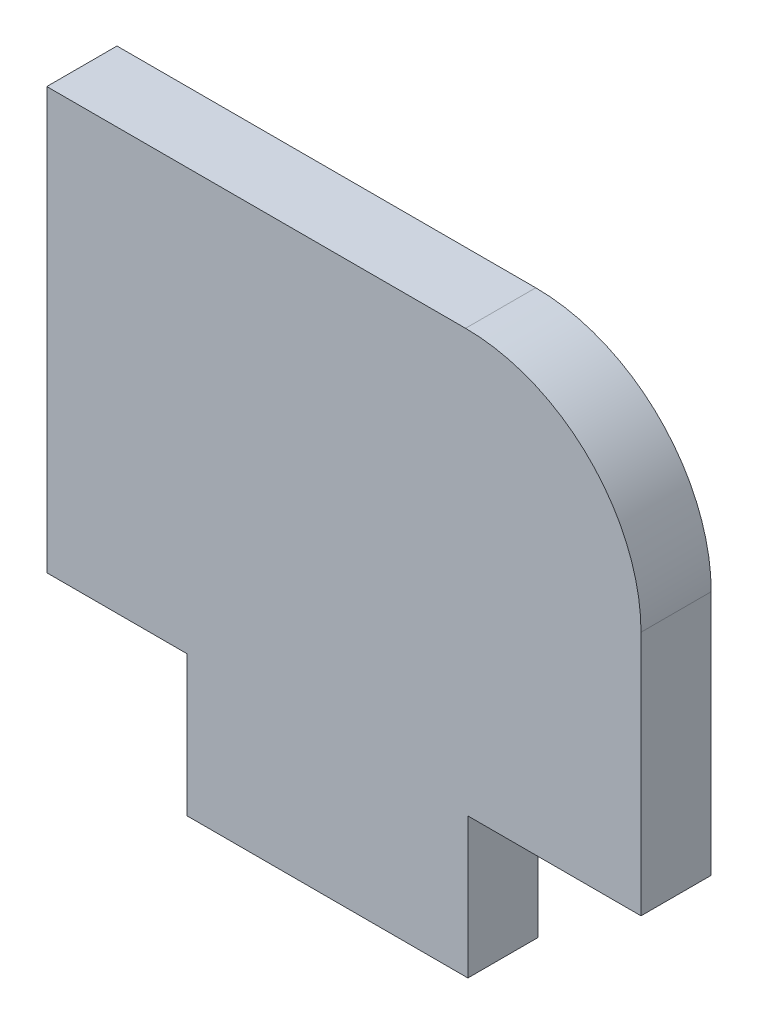
ISO-10303-21;
HEADER;
FILE_DESCRIPTION(('STEP AP214'),'2;1');
FILE_NAME('part.step','',(''),(''),'','','');
FILE_SCHEMA(('AUTOMOTIVE_DESIGN { 1 0 10303 214 1 1 1 1 }'));
ENDSEC;
DATA;
#1=APPLICATION_CONTEXT('core data for automotive mechanical design processes');
#2=APPLICATION_PROTOCOL_DEFINITION('international standard','automotive_design',2000,#1);
#3=PRODUCT_CONTEXT('',#1,'mechanical');
#4=PRODUCT('Part','Part','',(#3));
#5=PRODUCT_RELATED_PRODUCT_CATEGORY('part','',(#4));
#6=PRODUCT_DEFINITION_FORMATION('','',#4);
#7=PRODUCT_DEFINITION_CONTEXT('part definition',#1,'design');
#8=PRODUCT_DEFINITION('design','',#6,#7);
#9=PRODUCT_DEFINITION_SHAPE('','',#8);
#10=(LENGTH_UNIT() NAMED_UNIT(*) SI_UNIT(.MILLI.,.METRE.));
#11=(NAMED_UNIT(*) PLANE_ANGLE_UNIT() SI_UNIT($,.RADIAN.));
#12=(NAMED_UNIT(*) SI_UNIT($,.STERADIAN.) SOLID_ANGLE_UNIT());
#13=UNCERTAINTY_MEASURE_WITH_UNIT(LENGTH_MEASURE(1.E-05),#10,'distance_accuracy_value','');
#14=(GEOMETRIC_REPRESENTATION_CONTEXT(3) GLOBAL_UNCERTAINTY_ASSIGNED_CONTEXT((#13)) GLOBAL_UNIT_ASSIGNED_CONTEXT((#10,
#11,#12)) REPRESENTATION_CONTEXT('',''));
#15=CARTESIAN_POINT('',(0.,0.,0.));
#16=DIRECTION('',(0.,0.,1.));
#17=DIRECTION('',(1.,0.,0.));
#18=AXIS2_PLACEMENT_3D('',#15,#16,#17);
#19=CARTESIAN_POINT('',(-6.46658710236488,-4.,2.));
#20=DIRECTION('',(1.,0.,0.));
#21=DIRECTION('',(0.,0.,-1.));
#22=AXIS2_PLACEMENT_3D('',#19,#20,#21);
#23=PLANE('',#22);
#24=DIRECTION('',(0.,-1.,0.));
#25=VECTOR('',#24,1.);
#26=CARTESIAN_POINT('',(-6.46658710236488,-4.,0.));
#27=LINE('',#26,#25);
#28=CARTESIAN_POINT('',(-6.46658710236488,8.,0.));
#29=VERTEX_POINT('',#28);
#30=CARTESIAN_POINT('',(-6.46658710236488,-4.,0.));
#31=VERTEX_POINT('',#30);
#32=EDGE_CURVE('E134',#29,#31,#27,.T.);
#33=ORIENTED_EDGE('',*,*,#32,.T.);
#34=DIRECTION('',(0.,0.,-1.));
#35=VECTOR('',#34,1.);
#36=CARTESIAN_POINT('',(-6.46658710236488,-4.,2.));
#37=LINE('',#36,#35);
#38=CARTESIAN_POINT('',(-6.46658710236488,-4.,2.));
#39=VERTEX_POINT('',#38);
#40=EDGE_CURVE('E11',#39,#31,#37,.T.);
#41=ORIENTED_EDGE('',*,*,#40,.F.);
#42=DIRECTION('',(0.,-1.,0.));
#43=VECTOR('',#42,1.);
#44=CARTESIAN_POINT('',(-6.46658710236488,-4.,2.));
#45=LINE('',#44,#43);
#46=CARTESIAN_POINT('',(-6.46658710236488,8.,2.));
#47=VERTEX_POINT('',#46);
#48=EDGE_CURVE('E150',#47,#39,#45,.T.);
#49=ORIENTED_EDGE('',*,*,#48,.F.);
#50=DIRECTION('',(0.,0.,-1.));
#51=VECTOR('',#50,1.);
#52=CARTESIAN_POINT('',(-6.46658710236488,8.,2.));
#53=LINE('',#52,#51);
#54=EDGE_CURVE('E130',#47,#29,#53,.T.);
#55=ORIENTED_EDGE('',*,*,#54,.T.);
#56=EDGE_LOOP('',(#33,#41,#49,#55));
#57=FACE_BOUND('',#56,.T.);
#58=ADVANCED_FACE('F32',(#57),#23,.F.);
#59=CARTESIAN_POINT('',(-2.46658710236488,-4.,2.));
#60=DIRECTION('',(0.,1.,0.));
#61=DIRECTION('',(0.,0.,1.));
#62=AXIS2_PLACEMENT_3D('',#59,#60,#61);
#63=PLANE('',#62);
#64=DIRECTION('',(1.,0.,0.));
#65=VECTOR('',#64,1.);
#66=CARTESIAN_POINT('',(-2.46658710236488,-4.,0.));
#67=LINE('',#66,#65);
#68=CARTESIAN_POINT('',(-2.46658710236488,-4.,0.));
#69=VERTEX_POINT('',#68);
#70=EDGE_CURVE('E137',#31,#69,#67,.T.);
#71=ORIENTED_EDGE('',*,*,#70,.T.);
#72=DIRECTION('',(0.,0.,-1.));
#73=VECTOR('',#72,1.);
#74=CARTESIAN_POINT('',(-2.46658710236488,-4.,2.));
#75=LINE('',#74,#73);
#76=CARTESIAN_POINT('',(-2.46658710236488,-4.,2.));
#77=VERTEX_POINT('',#76);
#78=EDGE_CURVE('E40',#77,#69,#75,.T.);
#79=ORIENTED_EDGE('',*,*,#78,.F.);
#80=DIRECTION('',(1.,0.,0.));
#81=VECTOR('',#80,1.);
#82=CARTESIAN_POINT('',(-2.46658710236488,-4.,2.));
#83=LINE('',#82,#81);
#84=EDGE_CURVE('E94',#39,#77,#83,.T.);
#85=ORIENTED_EDGE('',*,*,#84,.F.);
#86=ORIENTED_EDGE('',*,*,#40,.T.);
#87=EDGE_LOOP('',(#71,#79,#85,#86));
#88=FACE_BOUND('',#87,.T.);
#89=ADVANCED_FACE('F193',(#88),#63,.F.);
#90=CARTESIAN_POINT('',(-2.46658710236488,-8.,2.));
#91=DIRECTION('',(1.,0.,0.));
#92=DIRECTION('',(0.,0.,-1.));
#93=AXIS2_PLACEMENT_3D('',#90,#91,#92);
#94=PLANE('',#93);
#95=DIRECTION('',(0.,-1.,0.));
#96=VECTOR('',#95,1.);
#97=CARTESIAN_POINT('',(-2.46658710236488,-8.,0.));
#98=LINE('',#97,#96);
#99=CARTESIAN_POINT('',(-2.46658710236488,-8.,0.));
#100=VERTEX_POINT('',#99);
#101=EDGE_CURVE('E139',#69,#100,#98,.T.);
#102=ORIENTED_EDGE('',*,*,#101,.T.);
#103=DIRECTION('',(0.,0.,-1.));
#104=VECTOR('',#103,1.);
#105=CARTESIAN_POINT('',(-2.46658710236488,-8.,2.));
#106=LINE('',#105,#104);
#107=CARTESIAN_POINT('',(-2.46658710236488,-8.,2.));
#108=VERTEX_POINT('',#107);
#109=EDGE_CURVE('E160',#108,#100,#106,.T.);
#110=ORIENTED_EDGE('',*,*,#109,.F.);
#111=DIRECTION('',(0.,-1.,0.));
#112=VECTOR('',#111,1.);
#113=CARTESIAN_POINT('',(-2.46658710236488,-8.,2.));
#114=LINE('',#113,#112);
#115=EDGE_CURVE('E168',#77,#108,#114,.T.);
#116=ORIENTED_EDGE('',*,*,#115,.F.);
#117=ORIENTED_EDGE('',*,*,#78,.T.);
#118=EDGE_LOOP('',(#102,#110,#116,#117));
#119=FACE_BOUND('',#118,.T.);
#120=ADVANCED_FACE('F166',(#119),#94,.F.);
#121=CARTESIAN_POINT('',(5.53341289763512,-8.,2.));
#122=DIRECTION('',(0.,1.,0.));
#123=DIRECTION('',(0.,0.,1.));
#124=AXIS2_PLACEMENT_3D('',#121,#122,#123);
#125=PLANE('',#124);
#126=DIRECTION('',(1.,0.,0.));
#127=VECTOR('',#126,1.);
#128=CARTESIAN_POINT('',(5.53341289763512,-8.,0.));
#129=LINE('',#128,#127);
#130=CARTESIAN_POINT('',(5.53341289763512,-8.,0.));
#131=VERTEX_POINT('',#130);
#132=EDGE_CURVE('E141',#100,#131,#129,.T.);
#133=ORIENTED_EDGE('',*,*,#132,.T.);
#134=DIRECTION('',(0.,0.,-1.));
#135=VECTOR('',#134,1.);
#136=CARTESIAN_POINT('',(5.53341289763512,-8.,2.));
#137=LINE('',#136,#135);
#138=CARTESIAN_POINT('',(5.53341289763512,-8.,2.));
#139=VERTEX_POINT('',#138);
#140=EDGE_CURVE('E157',#139,#131,#137,.T.);
#141=ORIENTED_EDGE('',*,*,#140,.F.);
#142=DIRECTION('',(1.,0.,0.));
#143=VECTOR('',#142,1.);
#144=CARTESIAN_POINT('',(5.53341289763512,-8.,2.));
#145=LINE('',#144,#143);
#146=EDGE_CURVE('E184',#108,#139,#145,.T.);
#147=ORIENTED_EDGE('',*,*,#146,.F.);
#148=ORIENTED_EDGE('',*,*,#109,.T.);
#149=EDGE_LOOP('',(#133,#141,#147,#148));
#150=FACE_BOUND('',#149,.T.);
#151=ADVANCED_FACE('F177',(#150),#125,.F.);
#152=CARTESIAN_POINT('',(5.53341289763512,-4.,2.));
#153=DIRECTION('',(-1.,0.,0.));
#154=DIRECTION('',(0.,0.,1.));
#155=AXIS2_PLACEMENT_3D('',#152,#153,#154);
#156=PLANE('',#155);
#157=DIRECTION('',(0.,1.,0.));
#158=VECTOR('',#157,1.);
#159=CARTESIAN_POINT('',(5.53341289763512,-4.,0.));
#160=LINE('',#159,#158);
#161=CARTESIAN_POINT('',(5.53341289763512,-4.,0.));
#162=VERTEX_POINT('',#161);
#163=EDGE_CURVE('E143',#131,#162,#160,.T.);
#164=ORIENTED_EDGE('',*,*,#163,.T.);
#165=DIRECTION('',(0.,0.,-1.));
#166=VECTOR('',#165,1.);
#167=CARTESIAN_POINT('',(5.53341289763512,-4.,2.));
#168=LINE('',#167,#166);
#169=CARTESIAN_POINT('',(5.53341289763512,-4.,2.));
#170=VERTEX_POINT('',#169);
#171=EDGE_CURVE('E154',#170,#162,#168,.T.);
#172=ORIENTED_EDGE('',*,*,#171,.F.);
#173=DIRECTION('',(0.,1.,0.));
#174=VECTOR('',#173,1.);
#175=CARTESIAN_POINT('',(5.53341289763512,-4.,2.));
#176=LINE('',#175,#174);
#177=EDGE_CURVE('E183',#139,#170,#176,.T.);
#178=ORIENTED_EDGE('',*,*,#177,.F.);
#179=ORIENTED_EDGE('',*,*,#140,.T.);
#180=EDGE_LOOP('',(#164,#172,#178,#179));
#181=FACE_BOUND('',#180,.T.);
#182=ADVANCED_FACE('F181',(#181),#156,.F.);
#183=CARTESIAN_POINT('',(5.53341289763512,-4.,2.));
#184=DIRECTION('',(0.,1.,0.));
#185=DIRECTION('',(0.,0.,1.));
#186=AXIS2_PLACEMENT_3D('',#183,#184,#185);
#187=PLANE('',#186);
#188=DIRECTION('',(1.,0.,0.));
#189=VECTOR('',#188,1.);
#190=CARTESIAN_POINT('',(5.53341289763512,-4.,0.));
#191=LINE('',#190,#189);
#192=CARTESIAN_POINT('',(10.4665871023649,-4.,0.));
#193=VERTEX_POINT('',#192);
#194=EDGE_CURVE('E145',#162,#193,#191,.T.);
#195=ORIENTED_EDGE('',*,*,#194,.T.);
#196=DIRECTION('',(0.,0.,-1.));
#197=VECTOR('',#196,1.);
#198=CARTESIAN_POINT('',(10.4665871023649,-4.,2.));
#199=LINE('',#198,#197);
#200=CARTESIAN_POINT('',(10.4665871023649,-4.,2.));
#201=VERTEX_POINT('',#200);
#202=EDGE_CURVE('E125',#201,#193,#199,.T.);
#203=ORIENTED_EDGE('',*,*,#202,.F.);
#204=DIRECTION('',(1.,0.,0.));
#205=VECTOR('',#204,1.);
#206=CARTESIAN_POINT('',(5.53341289763512,-4.,2.));
#207=LINE('',#206,#205);
#208=EDGE_CURVE('E116',#170,#201,#207,.T.);
#209=ORIENTED_EDGE('',*,*,#208,.F.);
#210=ORIENTED_EDGE('',*,*,#171,.T.);
#211=EDGE_LOOP('',(#195,#203,#209,#210));
#212=FACE_BOUND('',#211,.T.);
#213=ADVANCED_FACE('F205',(#212),#187,.F.);
#214=CARTESIAN_POINT('',(10.4665871023649,3.,2.));
#215=DIRECTION('',(-1.,0.,0.));
#216=DIRECTION('',(0.,0.,1.));
#217=AXIS2_PLACEMENT_3D('',#214,#215,#216);
#218=PLANE('',#217);
#219=DIRECTION('',(0.,1.,0.));
#220=VECTOR('',#219,1.);
#221=CARTESIAN_POINT('',(10.4665871023649,3.,0.));
#222=LINE('',#221,#220);
#223=CARTESIAN_POINT('',(10.4665871023649,3.,0.));
#224=VERTEX_POINT('',#223);
#225=EDGE_CURVE('E124',#193,#224,#222,.T.);
#226=ORIENTED_EDGE('',*,*,#225,.T.);
#227=DIRECTION('',(0.,0.,-1.));
#228=VECTOR('',#227,1.);
#229=CARTESIAN_POINT('',(10.4665871023649,3.,2.));
#230=LINE('',#229,#228);
#231=CARTESIAN_POINT('',(10.4665871023649,3.,2.));
#232=VERTEX_POINT('',#231);
#233=EDGE_CURVE('E121',#232,#224,#230,.T.);
#234=ORIENTED_EDGE('',*,*,#233,.F.);
#235=DIRECTION('',(0.,1.,0.));
#236=VECTOR('',#235,1.);
#237=CARTESIAN_POINT('',(10.4665871023649,3.,2.));
#238=LINE('',#237,#236);
#239=EDGE_CURVE('E110',#201,#232,#238,.T.);
#240=ORIENTED_EDGE('',*,*,#239,.F.);
#241=ORIENTED_EDGE('',*,*,#202,.T.);
#242=EDGE_LOOP('',(#226,#234,#240,#241));
#243=FACE_BOUND('',#242,.T.);
#244=ADVANCED_FACE('F122',(#243),#218,.F.);
#245=CARTESIAN_POINT('',(5.46658710236488,3.,2.));
#246=DIRECTION('',(0.,0.,-1.));
#247=DIRECTION('',(-1.,0.,0.));
#248=AXIS2_PLACEMENT_3D('',#245,#246,#247);
#249=CYLINDRICAL_SURFACE('',#248,5.);
#250=CARTESIAN_POINT('',(5.46658710236488,3.,0.));
#251=DIRECTION('',(0.,0.,1.));
#252=DIRECTION('',(1.,0.,0.));
#253=AXIS2_PLACEMENT_3D('',#250,#251,#252);
#254=CIRCLE('',#253,5.);
#255=CARTESIAN_POINT('',(5.46658710236488,8.,0.));
#256=VERTEX_POINT('',#255);
#257=EDGE_CURVE('E80',#224,#256,#254,.T.);
#258=ORIENTED_EDGE('',*,*,#257,.T.);
#259=DIRECTION('',(0.,0.,-1.));
#260=VECTOR('',#259,1.);
#261=CARTESIAN_POINT('',(5.46658710236488,8.,2.));
#262=LINE('',#261,#260);
#263=CARTESIAN_POINT('',(5.46658710236488,8.,2.));
#264=VERTEX_POINT('',#263);
#265=EDGE_CURVE('E126',#264,#256,#262,.T.);
#266=ORIENTED_EDGE('',*,*,#265,.F.);
#267=CARTESIAN_POINT('',(5.46658710236488,3.,2.));
#268=DIRECTION('',(0.,0.,1.));
#269=DIRECTION('',(1.,0.,0.));
#270=AXIS2_PLACEMENT_3D('',#267,#268,#269);
#271=CIRCLE('',#270,5.);
#272=EDGE_CURVE('E114',#232,#264,#271,.T.);
#273=ORIENTED_EDGE('',*,*,#272,.F.);
#274=ORIENTED_EDGE('',*,*,#233,.T.);
#275=EDGE_LOOP('',(#258,#266,#273,#274));
#276=FACE_BOUND('',#275,.T.);
#277=ADVANCED_FACE('F128',(#276),#249,.T.);
#278=CARTESIAN_POINT('',(-6.46658710236488,8.,2.));
#279=DIRECTION('',(0.,-1.,0.));
#280=DIRECTION('',(0.,0.,-1.));
#281=AXIS2_PLACEMENT_3D('',#278,#279,#280);
#282=PLANE('',#281);
#283=DIRECTION('',(-1.,0.,0.));
#284=VECTOR('',#283,1.);
#285=CARTESIAN_POINT('',(-6.46658710236488,8.,0.));
#286=LINE('',#285,#284);
#287=EDGE_CURVE('E86',#256,#29,#286,.T.);
#288=ORIENTED_EDGE('',*,*,#287,.T.);
#289=ORIENTED_EDGE('',*,*,#54,.F.);
#290=DIRECTION('',(-1.,0.,0.));
#291=VECTOR('',#290,1.);
#292=CARTESIAN_POINT('',(-6.46658710236488,8.,2.));
#293=LINE('',#292,#291);
#294=EDGE_CURVE('E48',#264,#47,#293,.T.);
#295=ORIENTED_EDGE('',*,*,#294,.F.);
#296=ORIENTED_EDGE('',*,*,#265,.T.);
#297=EDGE_LOOP('',(#288,#289,#295,#296));
#298=FACE_BOUND('',#297,.T.);
#299=ADVANCED_FACE('F213',(#298),#282,.F.);
#300=CARTESIAN_POINT('',(5.46658710236488,3.,2.));
#301=DIRECTION('',(0.,0.,1.));
#302=DIRECTION('',(1.,0.,0.));
#303=AXIS2_PLACEMENT_3D('',#300,#301,#302);
#304=PLANE('',#303);
#305=ORIENTED_EDGE('',*,*,#48,.T.);
#306=ORIENTED_EDGE('',*,*,#84,.T.);
#307=ORIENTED_EDGE('',*,*,#115,.T.);
#308=ORIENTED_EDGE('',*,*,#146,.T.);
#309=ORIENTED_EDGE('',*,*,#177,.T.);
#310=ORIENTED_EDGE('',*,*,#208,.T.);
#311=ORIENTED_EDGE('',*,*,#239,.T.);
#312=ORIENTED_EDGE('',*,*,#272,.T.);
#313=ORIENTED_EDGE('',*,*,#294,.T.);
#314=EDGE_LOOP('',(#305,#306,#307,#308,#309,#310,#311,#312,#313));
#315=FACE_BOUND('',#314,.T.);
#316=ADVANCED_FACE('F112',(#315),#304,.T.);
#317=CARTESIAN_POINT('',(5.46658710236488,3.,0.));
#318=DIRECTION('',(0.,0.,1.));
#319=DIRECTION('',(1.,0.,0.));
#320=AXIS2_PLACEMENT_3D('',#317,#318,#319);
#321=PLANE('',#320);
#322=ORIENTED_EDGE('',*,*,#32,.F.);
#323=ORIENTED_EDGE('',*,*,#287,.F.);
#324=ORIENTED_EDGE('',*,*,#257,.F.);
#325=ORIENTED_EDGE('',*,*,#225,.F.);
#326=ORIENTED_EDGE('',*,*,#194,.F.);
#327=ORIENTED_EDGE('',*,*,#163,.F.);
#328=ORIENTED_EDGE('',*,*,#132,.F.);
#329=ORIENTED_EDGE('',*,*,#101,.F.);
#330=ORIENTED_EDGE('',*,*,#70,.F.);
#331=EDGE_LOOP('',(#322,#323,#324,#325,#326,#327,#328,#329,#330));
#332=FACE_BOUND('',#331,.T.);
#333=ADVANCED_FACE('F172',(#332),#321,.F.);
#334=CLOSED_SHELL('',(#58,#89,#120,#151,#182,#213,#244,#277,#299,#316,#333));
#335=MANIFOLD_SOLID_BREP('B2',#334);
#336=ADVANCED_BREP_SHAPE_REPRESENTATION('',(#18,#335),#14);
#337=SHAPE_DEFINITION_REPRESENTATION(#9,#336);
ENDSEC;
END-ISO-10303-21;
